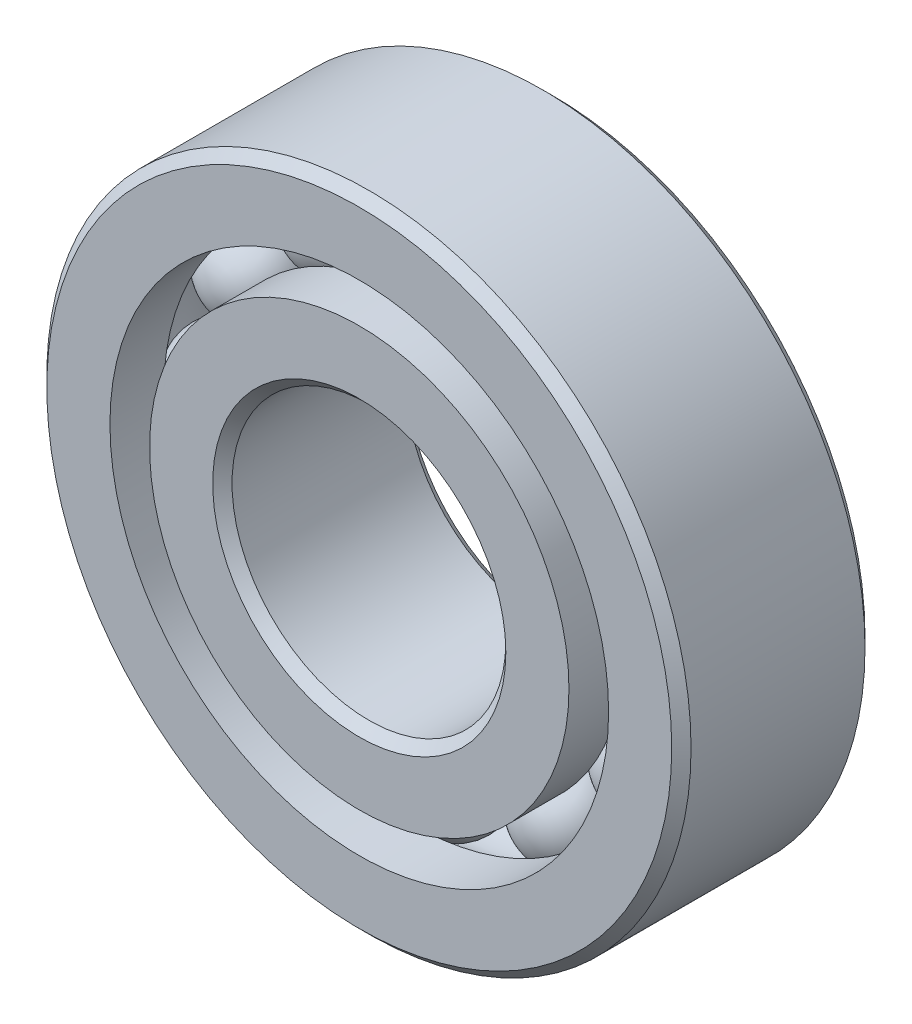
ISO-10303-21;
HEADER;
FILE_DESCRIPTION(('STEP AP214'),'2;1');
FILE_NAME('part.step','',(''),(''),'','','');
FILE_SCHEMA(('AUTOMOTIVE_DESIGN { 1 0 10303 214 1 1 1 1 }'));
ENDSEC;
DATA;
#1=APPLICATION_CONTEXT('core data for automotive mechanical design processes');
#2=APPLICATION_PROTOCOL_DEFINITION('international standard','automotive_design',2000,#1);
#3=PRODUCT_CONTEXT('',#1,'mechanical');
#4=PRODUCT('Part','Part','',(#3));
#5=PRODUCT_RELATED_PRODUCT_CATEGORY('part','',(#4));
#6=PRODUCT_DEFINITION_FORMATION('','',#4);
#7=PRODUCT_DEFINITION_CONTEXT('part definition',#1,'design');
#8=PRODUCT_DEFINITION('design','',#6,#7);
#9=PRODUCT_DEFINITION_SHAPE('','',#8);
#10=(LENGTH_UNIT() NAMED_UNIT(*) SI_UNIT(.MILLI.,.METRE.));
#11=(NAMED_UNIT(*) PLANE_ANGLE_UNIT() SI_UNIT($,.RADIAN.));
#12=(NAMED_UNIT(*) SI_UNIT($,.STERADIAN.) SOLID_ANGLE_UNIT());
#13=UNCERTAINTY_MEASURE_WITH_UNIT(LENGTH_MEASURE(1.E-05),#10,'distance_accuracy_value','');
#14=(GEOMETRIC_REPRESENTATION_CONTEXT(3) GLOBAL_UNCERTAINTY_ASSIGNED_CONTEXT((#13)) GLOBAL_UNIT_ASSIGNED_CONTEXT((#10,
#11,#12)) REPRESENTATION_CONTEXT('',''));
#15=CARTESIAN_POINT('',(0.,0.,0.));
#16=DIRECTION('',(0.,0.,1.));
#17=DIRECTION('',(1.,0.,0.));
#18=AXIS2_PLACEMENT_3D('',#15,#16,#17);
#19=CARTESIAN_POINT('',(-7.12499999999984,12.3408620039283,0.));
#20=DIRECTION('',(0.,0.,1.));
#21=DIRECTION('',(-0.499999999999989,0.866025403784445,0.));
#22=AXIS2_PLACEMENT_3D('',#19,#20,#21);
#23=SPHERICAL_SURFACE('',#22,2.93698893605669);
#24=CARTESIAN_POINT('',(-7.12499999999984,12.3408620039283,2.93698893605669));
#25=VERTEX_POINT('',#24);
#26=VERTEX_LOOP('',#25);
#27=FACE_BOUND('',#26,.T.);
#28=ADVANCED_FACE('F40',(#27),#23,.T.);
#29=CLOSED_SHELL('',(#28));
#30=MANIFOLD_SOLID_BREP('B2',#29);
#31=CARTESIAN_POINT('',(-12.3408620039282,7.12500000000014,0.));
#32=DIRECTION('',(0.,0.,1.));
#33=DIRECTION('',(-0.866025403784433,0.50000000000001,0.));
#34=AXIS2_PLACEMENT_3D('',#31,#32,#33);
#35=SPHERICAL_SURFACE('',#34,2.93698893605669);
#36=CARTESIAN_POINT('',(-12.3408620039282,7.12500000000014,2.93698893605669));
#37=VERTEX_POINT('',#36);
#38=VERTEX_LOOP('',#37);
#39=FACE_BOUND('',#38,.T.);
#40=ADVANCED_FACE('F61',(#39),#35,.T.);
#41=CLOSED_SHELL('',(#40));
#42=MANIFOLD_SOLID_BREP('B6',#41);
#43=CARTESIAN_POINT('',(-14.25,1.49260827235544E-13,0.));
#44=DIRECTION('',(0.,0.,1.));
#45=DIRECTION('',(-1.,0.,0.));
#46=AXIS2_PLACEMENT_3D('',#43,#44,#45);
#47=SPHERICAL_SURFACE('',#46,2.93698893605669);
#48=CARTESIAN_POINT('',(-14.25,1.49260827235544E-13,2.93698893605669));
#49=VERTEX_POINT('',#48);
#50=VERTEX_LOOP('',#49);
#51=FACE_BOUND('',#50,.T.);
#52=ADVANCED_FACE('F82',(#51),#47,.T.);
#53=CLOSED_SHELL('',(#52));
#54=MANIFOLD_SOLID_BREP('B36',#53);
#55=CARTESIAN_POINT('',(-12.3408620039283,-7.12499999999989,0.));
#56=DIRECTION('',(0.,0.,1.));
#57=DIRECTION('',(-0.866025403784443,-0.499999999999992,0.));
#58=AXIS2_PLACEMENT_3D('',#55,#56,#57);
#59=SPHERICAL_SURFACE('',#58,2.93698893605669);
#60=CARTESIAN_POINT('',(-12.3408620039283,-7.12499999999989,2.93698893605669));
#61=VERTEX_POINT('',#60);
#62=VERTEX_LOOP('',#61);
#63=FACE_BOUND('',#62,.T.);
#64=ADVANCED_FACE('F103',(#63),#59,.T.);
#65=CLOSED_SHELL('',(#64));
#66=MANIFOLD_SOLID_BREP('B57',#65);
#67=CARTESIAN_POINT('',(-7.1250000000001,-12.3408620039282,0.));
#68=DIRECTION('',(0.,0.,1.));
#69=DIRECTION('',(-0.500000000000007,-0.866025403784435,0.));
#70=AXIS2_PLACEMENT_3D('',#67,#68,#69);
#71=SPHERICAL_SURFACE('',#70,2.93698893605669);
#72=CARTESIAN_POINT('',(-7.1250000000001,-12.3408620039282,2.93698893605669));
#73=VERTEX_POINT('',#72);
#74=VERTEX_LOOP('',#73);
#75=FACE_BOUND('',#74,.T.);
#76=ADVANCED_FACE('F124',(#75),#71,.T.);
#77=CLOSED_SHELL('',(#76));
#78=MANIFOLD_SOLID_BREP('B78',#77);
#79=CARTESIAN_POINT('',(0.,-14.25,0.));
#80=DIRECTION('',(0.,0.,1.));
#81=DIRECTION('',(0.,-1.,0.));
#82=AXIS2_PLACEMENT_3D('',#79,#80,#81);
#83=SPHERICAL_SURFACE('',#82,2.93698893605669);
#84=CARTESIAN_POINT('',(0.,-14.25,2.93698893605669));
#85=VERTEX_POINT('',#84);
#86=VERTEX_LOOP('',#85);
#87=FACE_BOUND('',#86,.T.);
#88=ADVANCED_FACE('F145',(#87),#83,.T.);
#89=CLOSED_SHELL('',(#88));
#90=MANIFOLD_SOLID_BREP('B99',#89);
#91=CARTESIAN_POINT('',(7.12499999999993,-12.3408620039283,0.));
#92=DIRECTION('',(0.,0.,1.));
#93=DIRECTION('',(0.499999999999995,-0.866025403784442,0.));
#94=AXIS2_PLACEMENT_3D('',#91,#92,#93);
#95=SPHERICAL_SURFACE('',#94,2.93698893605669);
#96=CARTESIAN_POINT('',(7.12499999999993,-12.3408620039283,2.93698893605669));
#97=VERTEX_POINT('',#96);
#98=VERTEX_LOOP('',#97);
#99=FACE_BOUND('',#98,.T.);
#100=ADVANCED_FACE('F166',(#99),#95,.T.);
#101=CLOSED_SHELL('',(#100));
#102=MANIFOLD_SOLID_BREP('B120',#101);
#103=CARTESIAN_POINT('',(12.3408620039282,-7.12500000000006,0.));
#104=DIRECTION('',(0.,0.,1.));
#105=DIRECTION('',(0.866025403784436,-0.500000000000004,0.));
#106=AXIS2_PLACEMENT_3D('',#103,#104,#105);
#107=SPHERICAL_SURFACE('',#106,2.93698893605669);
#108=CARTESIAN_POINT('',(12.3408620039282,-7.12500000000006,2.93698893605669));
#109=VERTEX_POINT('',#108);
#110=VERTEX_LOOP('',#109);
#111=FACE_BOUND('',#110,.T.);
#112=ADVANCED_FACE('F187',(#111),#107,.T.);
#113=CLOSED_SHELL('',(#112));
#114=MANIFOLD_SOLID_BREP('B141',#113);
#115=CARTESIAN_POINT('',(14.25,0.,0.));
#116=DIRECTION('',(0.,0.,1.));
#117=DIRECTION('',(1.,0.,0.));
#118=AXIS2_PLACEMENT_3D('',#115,#116,#117);
#119=SPHERICAL_SURFACE('',#118,2.93698893605669);
#120=CARTESIAN_POINT('',(14.25,0.,2.93698893605669));
#121=VERTEX_POINT('',#120);
#122=VERTEX_LOOP('',#121);
#123=FACE_BOUND('',#122,.T.);
#124=ADVANCED_FACE('F208',(#123),#119,.T.);
#125=CLOSED_SHELL('',(#124));
#126=MANIFOLD_SOLID_BREP('B162',#125);
#127=CARTESIAN_POINT('',(12.3408620039283,7.12499999999997,0.));
#128=DIRECTION('',(0.,0.,1.));
#129=DIRECTION('',(0.86602540378444,0.499999999999998,0.));
#130=AXIS2_PLACEMENT_3D('',#127,#128,#129);
#131=SPHERICAL_SURFACE('',#130,2.93698893605669);
#132=CARTESIAN_POINT('',(12.3408620039283,7.12499999999997,2.93698893605669));
#133=VERTEX_POINT('',#132);
#134=VERTEX_LOOP('',#133);
#135=FACE_BOUND('',#134,.T.);
#136=ADVANCED_FACE('F229',(#135),#131,.T.);
#137=CLOSED_SHELL('',(#136));
#138=MANIFOLD_SOLID_BREP('B183',#137);
#139=CARTESIAN_POINT('',(7.12500000000001,12.3408620039282,0.));
#140=DIRECTION('',(0.,0.,1.));
#141=DIRECTION('',(0.500000000000001,0.866025403784438,0.));
#142=AXIS2_PLACEMENT_3D('',#139,#140,#141);
#143=SPHERICAL_SURFACE('',#142,2.93698893605669);
#144=CARTESIAN_POINT('',(7.12500000000001,12.3408620039282,2.93698893605669));
#145=VERTEX_POINT('',#144);
#146=VERTEX_LOOP('',#145);
#147=FACE_BOUND('',#146,.T.);
#148=ADVANCED_FACE('F250',(#147),#143,.T.);
#149=CLOSED_SHELL('',(#148));
#150=MANIFOLD_SOLID_BREP('B204',#149);
#151=CARTESIAN_POINT('',(0.,14.25,0.));
#152=DIRECTION('',(0.,0.,1.));
#153=DIRECTION('',(0.,1.,0.));
#154=AXIS2_PLACEMENT_3D('',#151,#152,#153);
#155=SPHERICAL_SURFACE('',#154,2.93698893605669);
#156=CARTESIAN_POINT('',(0.,14.25,2.93698893605669));
#157=VERTEX_POINT('',#156);
#158=VERTEX_LOOP('',#157);
#159=FACE_BOUND('',#158,.T.);
#160=ADVANCED_FACE('F273',(#159),#155,.T.);
#161=CLOSED_SHELL('',(#160));
#162=MANIFOLD_SOLID_BREP('B225',#161);
#163=CARTESIAN_POINT('',(0.,13.0192307692308,6.));
#164=DIRECTION('',(0.,0.,-1.));
#165=DIRECTION('',(-1.,0.,0.));
#166=AXIS2_PLACEMENT_3D('',#163,#164,#165);
#167=PLANE('',#166);
#168=CARTESIAN_POINT('',(0.,0.,6.));
#169=DIRECTION('',(0.,0.,1.));
#170=DIRECTION('',(1.,0.,0.));
#171=AXIS2_PLACEMENT_3D('',#168,#169,#170);
#172=CIRCLE('',#171,9.1);
#173=CARTESIAN_POINT('',(9.1,0.,6.));
#174=VERTEX_POINT('',#173);
#175=EDGE_CURVE('E321',#174,#174,#172,.T.);
#176=ORIENTED_EDGE('',*,*,#175,.F.);
#177=EDGE_LOOP('',(#176));
#178=FACE_BOUND('',#177,.T.);
#179=CARTESIAN_POINT('',(0.,0.,6.));
#180=DIRECTION('',(0.,0.,1.));
#181=DIRECTION('',(1.,0.,0.));
#182=AXIS2_PLACEMENT_3D('',#179,#180,#181);
#183=CIRCLE('',#182,13.0192307692308);
#184=CARTESIAN_POINT('',(13.0192307692308,0.,6.));
#185=VERTEX_POINT('',#184);
#186=EDGE_CURVE('E272',#185,#185,#183,.T.);
#187=ORIENTED_EDGE('',*,*,#186,.T.);
#188=EDGE_LOOP('',(#187));
#189=FACE_BOUND('',#188,.T.);
#190=ADVANCED_FACE('F293',(#178,#189),#167,.F.);
#191=CARTESIAN_POINT('',(0.,0.,6.));
#192=DIRECTION('',(0.,0.,1.));
#193=DIRECTION('',(1.,0.,0.));
#194=AXIS2_PLACEMENT_3D('',#191,#192,#193);
#195=CYLINDRICAL_SURFACE('',#194,13.0192307692308);
#196=ORIENTED_EDGE('',*,*,#186,.F.);
#197=EDGE_LOOP('',(#196));
#198=FACE_BOUND('',#197,.T.);
#199=CARTESIAN_POINT('',(0.,0.,2.66666666666667));
#200=DIRECTION('',(0.,0.,1.));
#201=DIRECTION('',(1.,0.,0.));
#202=AXIS2_PLACEMENT_3D('',#199,#200,#201);
#203=CIRCLE('',#202,13.0192307692308);
#204=CARTESIAN_POINT('',(13.0192307692308,0.,2.66666666666667));
#205=VERTEX_POINT('',#204);
#206=EDGE_CURVE('E299',#205,#205,#203,.T.);
#207=ORIENTED_EDGE('',*,*,#206,.T.);
#208=EDGE_LOOP('',(#207));
#209=FACE_BOUND('',#208,.T.);
#210=ADVANCED_FACE('F328',(#198,#209),#195,.T.);
#211=CARTESIAN_POINT('',(0.,0.,0.));
#212=DIRECTION('',(0.,0.,1.));
#213=DIRECTION('',(1.,0.,0.));
#214=AXIS2_PLACEMENT_3D('',#211,#212,#213);
#215=TOROIDAL_SURFACE('',#214,14.25,2.93698893605668);
#216=ORIENTED_EDGE('',*,*,#206,.F.);
#217=EDGE_LOOP('',(#216));
#218=FACE_BOUND('',#217,.T.);
#219=CARTESIAN_POINT('',(0.,0.,-2.66666666666667));
#220=DIRECTION('',(0.,0.,1.));
#221=DIRECTION('',(1.,0.,0.));
#222=AXIS2_PLACEMENT_3D('',#219,#220,#221);
#223=CIRCLE('',#222,13.0192307692308);
#224=CARTESIAN_POINT('',(13.0192307692308,0.,-2.66666666666667));
#225=VERTEX_POINT('',#224);
#226=EDGE_CURVE('E303',#225,#225,#223,.T.);
#227=ORIENTED_EDGE('',*,*,#226,.T.);
#228=EDGE_LOOP('',(#227));
#229=FACE_BOUND('',#228,.T.);
#230=ADVANCED_FACE('F332',(#218,#229),#215,.F.);
#231=CARTESIAN_POINT('',(0.,0.,6.));
#232=DIRECTION('',(0.,0.,1.));
#233=DIRECTION('',(1.,0.,0.));
#234=AXIS2_PLACEMENT_3D('',#231,#232,#233);
#235=CYLINDRICAL_SURFACE('',#234,13.0192307692308);
#236=ORIENTED_EDGE('',*,*,#226,.F.);
#237=EDGE_LOOP('',(#236));
#238=FACE_BOUND('',#237,.T.);
#239=CARTESIAN_POINT('',(0.,0.,-6.));
#240=DIRECTION('',(0.,0.,1.));
#241=DIRECTION('',(1.,0.,0.));
#242=AXIS2_PLACEMENT_3D('',#239,#240,#241);
#243=CIRCLE('',#242,13.0192307692308);
#244=CARTESIAN_POINT('',(13.0192307692308,0.,-6.));
#245=VERTEX_POINT('',#244);
#246=EDGE_CURVE('E307',#245,#245,#243,.T.);
#247=ORIENTED_EDGE('',*,*,#246,.T.);
#248=EDGE_LOOP('',(#247));
#249=FACE_BOUND('',#248,.T.);
#250=ADVANCED_FACE('F337',(#238,#249),#235,.T.);
#251=CARTESIAN_POINT('',(0.,9.1,-6.));
#252=DIRECTION('',(0.,0.,1.));
#253=DIRECTION('',(1.,0.,0.));
#254=AXIS2_PLACEMENT_3D('',#251,#252,#253);
#255=PLANE('',#254);
#256=ORIENTED_EDGE('',*,*,#246,.F.);
#257=EDGE_LOOP('',(#256));
#258=FACE_BOUND('',#257,.T.);
#259=CARTESIAN_POINT('',(0.,0.,-6.));
#260=DIRECTION('',(0.,0.,1.));
#261=DIRECTION('',(1.,0.,0.));
#262=AXIS2_PLACEMENT_3D('',#259,#260,#261);
#263=CIRCLE('',#262,9.1);
#264=CARTESIAN_POINT('',(9.1,0.,-6.));
#265=VERTEX_POINT('',#264);
#266=EDGE_CURVE('E312',#265,#265,#263,.T.);
#267=ORIENTED_EDGE('',*,*,#266,.T.);
#268=EDGE_LOOP('',(#267));
#269=FACE_BOUND('',#268,.T.);
#270=ADVANCED_FACE('F343',(#258,#269),#255,.F.);
#271=CARTESIAN_POINT('',(0.,0.,-5.4));
#272=DIRECTION('',(0.,0.,-1.));
#273=DIRECTION('',(-1.,0.,0.));
#274=AXIS2_PLACEMENT_3D('',#271,#272,#273);
#275=CONICAL_SURFACE('',#274,8.5,0.785398163397447);
#276=ORIENTED_EDGE('',*,*,#266,.F.);
#277=EDGE_LOOP('',(#276));
#278=FACE_BOUND('',#277,.T.);
#279=CARTESIAN_POINT('',(0.,0.,-5.4));
#280=DIRECTION('',(0.,0.,1.));
#281=DIRECTION('',(1.,0.,0.));
#282=AXIS2_PLACEMENT_3D('',#279,#280,#281);
#283=CIRCLE('',#282,8.5);
#284=CARTESIAN_POINT('',(8.5,0.,-5.4));
#285=VERTEX_POINT('',#284);
#286=EDGE_CURVE('E315',#285,#285,#283,.T.);
#287=ORIENTED_EDGE('',*,*,#286,.T.);
#288=EDGE_LOOP('',(#287));
#289=FACE_BOUND('',#288,.T.);
#290=ADVANCED_FACE('F347',(#278,#289),#275,.F.);
#291=CARTESIAN_POINT('',(0.,0.,6.));
#292=DIRECTION('',(0.,0.,1.));
#293=DIRECTION('',(1.,0.,0.));
#294=AXIS2_PLACEMENT_3D('',#291,#292,#293);
#295=CYLINDRICAL_SURFACE('',#294,8.5);
#296=ORIENTED_EDGE('',*,*,#286,.F.);
#297=EDGE_LOOP('',(#296));
#298=FACE_BOUND('',#297,.T.);
#299=CARTESIAN_POINT('',(0.,0.,5.4));
#300=DIRECTION('',(0.,0.,1.));
#301=DIRECTION('',(1.,0.,0.));
#302=AXIS2_PLACEMENT_3D('',#299,#300,#301);
#303=CIRCLE('',#302,8.5);
#304=CARTESIAN_POINT('',(8.5,0.,5.4));
#305=VERTEX_POINT('',#304);
#306=EDGE_CURVE('E318',#305,#305,#303,.T.);
#307=ORIENTED_EDGE('',*,*,#306,.T.);
#308=EDGE_LOOP('',(#307));
#309=FACE_BOUND('',#308,.T.);
#310=ADVANCED_FACE('F351',(#298,#309),#295,.F.);
#311=CARTESIAN_POINT('',(0.,0.,6.));
#312=DIRECTION('',(0.,0.,1.));
#313=DIRECTION('',(1.,0.,0.));
#314=AXIS2_PLACEMENT_3D('',#311,#312,#313);
#315=CONICAL_SURFACE('',#314,9.1,0.78539816339745);
#316=ORIENTED_EDGE('',*,*,#306,.F.);
#317=EDGE_LOOP('',(#316));
#318=FACE_BOUND('',#317,.T.);
#319=ORIENTED_EDGE('',*,*,#175,.T.);
#320=EDGE_LOOP('',(#319));
#321=FACE_BOUND('',#320,.T.);
#322=ADVANCED_FACE('F325',(#318,#321),#315,.F.);
#323=CLOSED_SHELL('',(#190,#210,#230,#250,#270,#290,#310,#322));
#324=MANIFOLD_SOLID_BREP('B246',#323);
#325=CARTESIAN_POINT('',(0.,0.,5.4));
#326=DIRECTION('',(0.,0.,-1.));
#327=DIRECTION('',(-1.,0.,0.));
#328=AXIS2_PLACEMENT_3D('',#325,#326,#327);
#329=CONICAL_SURFACE('',#328,20.,0.785398163397448);
#330=CARTESIAN_POINT('',(0.,0.,6.));
#331=DIRECTION('',(0.,0.,1.));
#332=DIRECTION('',(1.,0.,0.));
#333=AXIS2_PLACEMENT_3D('',#330,#331,#332);
#334=CIRCLE('',#333,19.4);
#335=CARTESIAN_POINT('',(19.4,0.,6.));
#336=VERTEX_POINT('',#335);
#337=EDGE_CURVE('E443',#336,#336,#334,.T.);
#338=ORIENTED_EDGE('',*,*,#337,.F.);
#339=EDGE_LOOP('',(#338));
#340=FACE_BOUND('',#339,.T.);
#341=CARTESIAN_POINT('',(0.,0.,5.4));
#342=DIRECTION('',(0.,0.,1.));
#343=DIRECTION('',(1.,0.,0.));
#344=AXIS2_PLACEMENT_3D('',#341,#342,#343);
#345=CIRCLE('',#344,20.);
#346=CARTESIAN_POINT('',(20.,0.,5.4));
#347=VERTEX_POINT('',#346);
#348=EDGE_CURVE('E292',#347,#347,#345,.T.);
#349=ORIENTED_EDGE('',*,*,#348,.T.);
#350=EDGE_LOOP('',(#349));
#351=FACE_BOUND('',#350,.T.);
#352=ADVANCED_FACE('F415',(#340,#351),#329,.T.);
#353=CARTESIAN_POINT('',(0.,0.,6.));
#354=DIRECTION('',(0.,0.,1.));
#355=DIRECTION('',(1.,0.,0.));
#356=AXIS2_PLACEMENT_3D('',#353,#354,#355);
#357=CYLINDRICAL_SURFACE('',#356,20.);
#358=ORIENTED_EDGE('',*,*,#348,.F.);
#359=EDGE_LOOP('',(#358));
#360=FACE_BOUND('',#359,.T.);
#361=CARTESIAN_POINT('',(0.,0.,-5.4));
#362=DIRECTION('',(0.,0.,1.));
#363=DIRECTION('',(1.,0.,0.));
#364=AXIS2_PLACEMENT_3D('',#361,#362,#363);
#365=CIRCLE('',#364,20.);
#366=CARTESIAN_POINT('',(20.,0.,-5.4));
#367=VERTEX_POINT('',#366);
#368=EDGE_CURVE('E421',#367,#367,#365,.T.);
#369=ORIENTED_EDGE('',*,*,#368,.T.);
#370=EDGE_LOOP('',(#369));
#371=FACE_BOUND('',#370,.T.);
#372=ADVANCED_FACE('F450',(#360,#371),#357,.T.);
#373=CARTESIAN_POINT('',(0.,0.,-6.));
#374=DIRECTION('',(0.,0.,1.));
#375=DIRECTION('',(1.,0.,0.));
#376=AXIS2_PLACEMENT_3D('',#373,#374,#375);
#377=CONICAL_SURFACE('',#376,19.4,0.785398163397447);
#378=ORIENTED_EDGE('',*,*,#368,.F.);
#379=EDGE_LOOP('',(#378));
#380=FACE_BOUND('',#379,.T.);
#381=CARTESIAN_POINT('',(0.,0.,-6.));
#382=DIRECTION('',(0.,0.,1.));
#383=DIRECTION('',(1.,0.,0.));
#384=AXIS2_PLACEMENT_3D('',#381,#382,#383);
#385=CIRCLE('',#384,19.4);
#386=CARTESIAN_POINT('',(19.4,0.,-6.));
#387=VERTEX_POINT('',#386);
#388=EDGE_CURVE('E425',#387,#387,#385,.T.);
#389=ORIENTED_EDGE('',*,*,#388,.T.);
#390=EDGE_LOOP('',(#389));
#391=FACE_BOUND('',#390,.T.);
#392=ADVANCED_FACE('F454',(#380,#391),#377,.T.);
#393=CARTESIAN_POINT('',(0.,19.4,-6.));
#394=DIRECTION('',(0.,0.,1.));
#395=DIRECTION('',(1.,0.,0.));
#396=AXIS2_PLACEMENT_3D('',#393,#394,#395);
#397=PLANE('',#396);
#398=ORIENTED_EDGE('',*,*,#388,.F.);
#399=EDGE_LOOP('',(#398));
#400=FACE_BOUND('',#399,.T.);
#401=CARTESIAN_POINT('',(0.,0.,-6.));
#402=DIRECTION('',(0.,0.,1.));
#403=DIRECTION('',(1.,0.,0.));
#404=AXIS2_PLACEMENT_3D('',#401,#402,#403);
#405=CIRCLE('',#404,15.4807692307692);
#406=CARTESIAN_POINT('',(15.4807692307692,0.,-6.));
#407=VERTEX_POINT('',#406);
#408=EDGE_CURVE('E429',#407,#407,#405,.T.);
#409=ORIENTED_EDGE('',*,*,#408,.T.);
#410=EDGE_LOOP('',(#409));
#411=FACE_BOUND('',#410,.T.);
#412=ADVANCED_FACE('F459',(#400,#411),#397,.F.);
#413=CARTESIAN_POINT('',(0.,0.,6.));
#414=DIRECTION('',(0.,0.,1.));
#415=DIRECTION('',(1.,0.,0.));
#416=AXIS2_PLACEMENT_3D('',#413,#414,#415);
#417=CYLINDRICAL_SURFACE('',#416,15.4807692307692);
#418=ORIENTED_EDGE('',*,*,#408,.F.);
#419=EDGE_LOOP('',(#418));
#420=FACE_BOUND('',#419,.T.);
#421=CARTESIAN_POINT('',(0.,0.,-2.66666666666667));
#422=DIRECTION('',(0.,0.,1.));
#423=DIRECTION('',(1.,0.,0.));
#424=AXIS2_PLACEMENT_3D('',#421,#422,#423);
#425=CIRCLE('',#424,15.4807692307692);
#426=CARTESIAN_POINT('',(15.4807692307692,0.,-2.66666666666667));
#427=VERTEX_POINT('',#426);
#428=EDGE_CURVE('E434',#427,#427,#425,.T.);
#429=ORIENTED_EDGE('',*,*,#428,.T.);
#430=EDGE_LOOP('',(#429));
#431=FACE_BOUND('',#430,.T.);
#432=ADVANCED_FACE('F465',(#420,#431),#417,.F.);
#433=CARTESIAN_POINT('',(0.,0.,0.));
#434=DIRECTION('',(0.,0.,1.));
#435=DIRECTION('',(1.,0.,0.));
#436=AXIS2_PLACEMENT_3D('',#433,#434,#435);
#437=TOROIDAL_SURFACE('',#436,14.25,2.93698893605669);
#438=ORIENTED_EDGE('',*,*,#428,.F.);
#439=EDGE_LOOP('',(#438));
#440=FACE_BOUND('',#439,.T.);
#441=CARTESIAN_POINT('',(0.,0.,2.66666666666667));
#442=DIRECTION('',(0.,0.,1.));
#443=DIRECTION('',(1.,0.,0.));
#444=AXIS2_PLACEMENT_3D('',#441,#442,#443);
#445=CIRCLE('',#444,15.4807692307692);
#446=CARTESIAN_POINT('',(15.4807692307692,0.,2.66666666666667));
#447=VERTEX_POINT('',#446);
#448=EDGE_CURVE('E437',#447,#447,#445,.T.);
#449=ORIENTED_EDGE('',*,*,#448,.T.);
#450=EDGE_LOOP('',(#449));
#451=FACE_BOUND('',#450,.T.);
#452=ADVANCED_FACE('F469',(#440,#451),#437,.F.);
#453=CARTESIAN_POINT('',(0.,0.,6.));
#454=DIRECTION('',(0.,0.,1.));
#455=DIRECTION('',(1.,0.,0.));
#456=AXIS2_PLACEMENT_3D('',#453,#454,#455);
#457=CYLINDRICAL_SURFACE('',#456,15.4807692307692);
#458=ORIENTED_EDGE('',*,*,#448,.F.);
#459=EDGE_LOOP('',(#458));
#460=FACE_BOUND('',#459,.T.);
#461=CARTESIAN_POINT('',(0.,0.,6.));
#462=DIRECTION('',(0.,0.,1.));
#463=DIRECTION('',(1.,0.,0.));
#464=AXIS2_PLACEMENT_3D('',#461,#462,#463);
#465=CIRCLE('',#464,15.4807692307692);
#466=CARTESIAN_POINT('',(15.4807692307692,0.,6.));
#467=VERTEX_POINT('',#466);
#468=EDGE_CURVE('E440',#467,#467,#465,.T.);
#469=ORIENTED_EDGE('',*,*,#468,.T.);
#470=EDGE_LOOP('',(#469));
#471=FACE_BOUND('',#470,.T.);
#472=ADVANCED_FACE('F473',(#460,#471),#457,.F.);
#473=CARTESIAN_POINT('',(0.,19.4,6.));
#474=DIRECTION('',(0.,0.,-1.));
#475=DIRECTION('',(-1.,0.,0.));
#476=AXIS2_PLACEMENT_3D('',#473,#474,#475);
#477=PLANE('',#476);
#478=ORIENTED_EDGE('',*,*,#468,.F.);
#479=EDGE_LOOP('',(#478));
#480=FACE_BOUND('',#479,.T.);
#481=ORIENTED_EDGE('',*,*,#337,.T.);
#482=EDGE_LOOP('',(#481));
#483=FACE_BOUND('',#482,.T.);
#484=ADVANCED_FACE('F447',(#480,#483),#477,.F.);
#485=CLOSED_SHELL('',(#352,#372,#392,#412,#432,#452,#472,#484));
#486=MANIFOLD_SOLID_BREP('B267',#485);
#487=ADVANCED_BREP_SHAPE_REPRESENTATION('',(#18,#30,#42,#54,#66,#78,#90,#102,#114,#126,#138,
#150,#162,#324,#486),#14);
#488=SHAPE_DEFINITION_REPRESENTATION(#9,#487);
ENDSEC;
END-ISO-10303-21;
